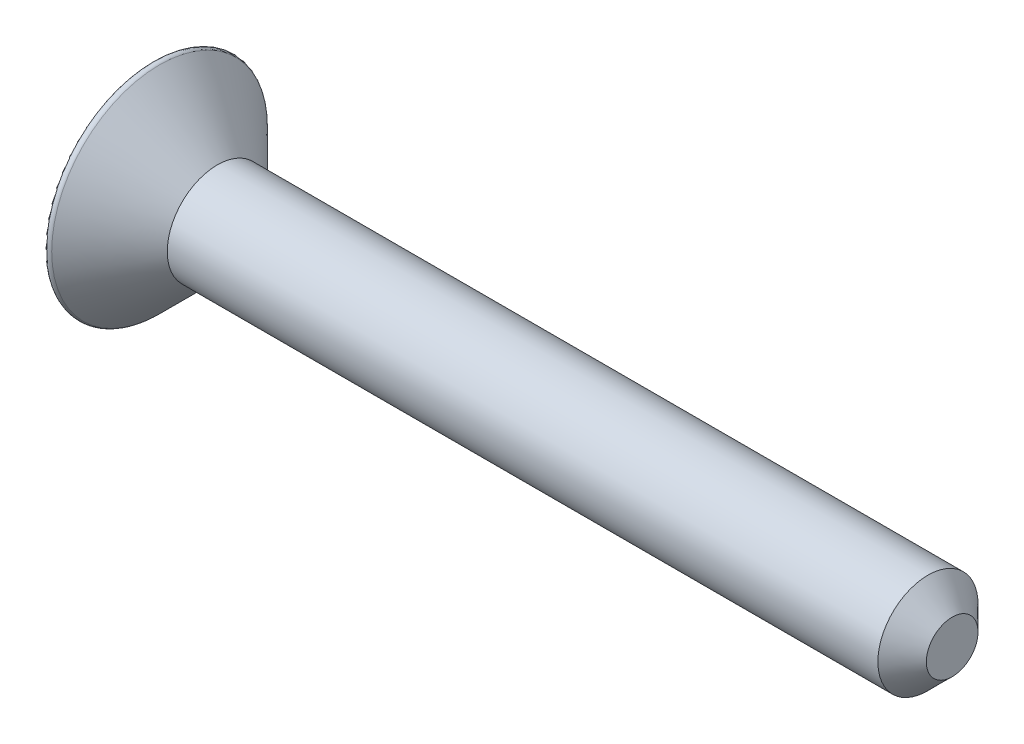
ISO-10303-21;
HEADER;
FILE_DESCRIPTION(('STEP AP214'),'2;1');
FILE_NAME('part.step','',(''),(''),'','','');
FILE_SCHEMA(('AUTOMOTIVE_DESIGN { 1 0 10303 214 1 1 1 1 }'));
ENDSEC;
DATA;
#1=APPLICATION_CONTEXT('core data for automotive mechanical design processes');
#2=APPLICATION_PROTOCOL_DEFINITION('international standard','automotive_design',2000,#1);
#3=PRODUCT_CONTEXT('',#1,'mechanical');
#4=PRODUCT('Part','Part','',(#3));
#5=PRODUCT_RELATED_PRODUCT_CATEGORY('part','',(#4));
#6=PRODUCT_DEFINITION_FORMATION('','',#4);
#7=PRODUCT_DEFINITION_CONTEXT('part definition',#1,'design');
#8=PRODUCT_DEFINITION('design','',#6,#7);
#9=PRODUCT_DEFINITION_SHAPE('','',#8);
#10=(LENGTH_UNIT() NAMED_UNIT(*) SI_UNIT(.MILLI.,.METRE.));
#11=(NAMED_UNIT(*) PLANE_ANGLE_UNIT() SI_UNIT($,.RADIAN.));
#12=(NAMED_UNIT(*) SI_UNIT($,.STERADIAN.) SOLID_ANGLE_UNIT());
#13=UNCERTAINTY_MEASURE_WITH_UNIT(LENGTH_MEASURE(1.E-05),#10,'distance_accuracy_value','');
#14=(GEOMETRIC_REPRESENTATION_CONTEXT(3) GLOBAL_UNCERTAINTY_ASSIGNED_CONTEXT((#13)) GLOBAL_UNIT_ASSIGNED_CONTEXT((#10,
#11,#12)) REPRESENTATION_CONTEXT('',''));
#15=CARTESIAN_POINT('',(0.,0.,0.));
#16=DIRECTION('',(0.,0.,1.));
#17=DIRECTION('',(1.,0.,0.));
#18=AXIS2_PLACEMENT_3D('',#15,#16,#17);
#19=CARTESIAN_POINT('',(0.,0.,0.));
#20=DIRECTION('',(1.,0.,0.));
#21=DIRECTION('',(0.,1.,0.));
#22=AXIS2_PLACEMENT_3D('',#19,#20,#21);
#23=PLANE('',#22);
#24=CARTESIAN_POINT('',(0.,0.,0.));
#25=DIRECTION('',(1.,0.,0.));
#26=DIRECTION('',(0.,1.,0.));
#27=AXIS2_PLACEMENT_3D('',#24,#25,#26);
#28=CIRCLE('',#27,0.812799999999999);
#29=CARTESIAN_POINT('',(0.,0.812799999999999,0.));
#30=VERTEX_POINT('',#29);
#31=EDGE_CURVE('E11',#30,#30,#28,.T.);
#32=ORIENTED_EDGE('',*,*,#31,.T.);
#33=EDGE_LOOP('',(#32));
#34=FACE_BOUND('',#33,.T.);
#35=ADVANCED_FACE('F38',(#34),#23,.T.);
#36=CARTESIAN_POINT('',(0.,0.,0.));
#37=DIRECTION('',(-1.,0.,0.));
#38=DIRECTION('',(0.,-1.,0.));
#39=AXIS2_PLACEMENT_3D('',#36,#37,#38);
#40=CONICAL_SURFACE('',#39,0.812799999999999,0.785398163397449);
#41=CARTESIAN_POINT('',(-0.761999999999999,0.,0.));
#42=DIRECTION('',(1.,0.,0.));
#43=DIRECTION('',(0.,1.,0.));
#44=AXIS2_PLACEMENT_3D('',#41,#42,#43);
#45=CIRCLE('',#44,1.5748);
#46=CARTESIAN_POINT('',(-0.761999999999999,1.57480000000001,0.));
#47=VERTEX_POINT('',#46);
#48=EDGE_CURVE('E45',#47,#47,#45,.T.);
#49=ORIENTED_EDGE('',*,*,#48,.T.);
#50=EDGE_LOOP('',(#49));
#51=FACE_BOUND('',#50,.T.);
#52=ORIENTED_EDGE('',*,*,#31,.F.);
#53=EDGE_LOOP('',(#52));
#54=FACE_BOUND('',#53,.T.);
#55=ADVANCED_FACE('F196',(#51,#54),#40,.T.);
#56=CARTESIAN_POINT('',(0.,0.,0.));
#57=DIRECTION('',(1.,0.,0.));
#58=DIRECTION('',(0.,1.,0.));
#59=AXIS2_PLACEMENT_3D('',#56,#57,#58);
#60=CYLINDRICAL_SURFACE('',#59,1.5748);
#61=CARTESIAN_POINT('',(-23.1121948775787,0.,0.));
#62=DIRECTION('',(1.,0.,0.));
#63=DIRECTION('',(0.,1.,0.));
#64=AXIS2_PLACEMENT_3D('',#61,#62,#63);
#65=CIRCLE('',#64,1.5748);
#66=CARTESIAN_POINT('',(-23.1121948775787,1.57480000000002,0.));
#67=VERTEX_POINT('',#66);
#68=EDGE_CURVE('E191',#67,#67,#65,.T.);
#69=ORIENTED_EDGE('',*,*,#68,.T.);
#70=EDGE_LOOP('',(#69));
#71=FACE_BOUND('',#70,.T.);
#72=ORIENTED_EDGE('',*,*,#48,.F.);
#73=EDGE_LOOP('',(#72));
#74=FACE_BOUND('',#73,.T.);
#75=ADVANCED_FACE('F199',(#71,#74),#60,.T.);
#76=CARTESIAN_POINT('',(-23.1121948775787,0.,0.));
#77=DIRECTION('',(-1.,0.,0.));
#78=DIRECTION('',(0.,-1.,0.));
#79=AXIS2_PLACEMENT_3D('',#76,#77,#78);
#80=CONICAL_SURFACE('',#79,1.5748,0.785398163397454);
#81=CARTESIAN_POINT('',(-24.9291974387893,0.,0.));
#82=DIRECTION('',(1.,0.,0.));
#83=DIRECTION('',(0.,1.,0.));
#84=AXIS2_PLACEMENT_3D('',#81,#82,#83);
#85=CIRCLE('',#84,3.39180256121069);
#86=CARTESIAN_POINT('',(-24.9291974387893,3.39180256121071,0.));
#87=VERTEX_POINT('',#86);
#88=EDGE_CURVE('E188',#87,#87,#85,.T.);
#89=ORIENTED_EDGE('',*,*,#88,.T.);
#90=EDGE_LOOP('',(#89));
#91=FACE_BOUND('',#90,.T.);
#92=ORIENTED_EDGE('',*,*,#68,.F.);
#93=EDGE_LOOP('',(#92));
#94=FACE_BOUND('',#93,.T.);
#95=ADVANCED_FACE('F201',(#91,#94),#80,.T.);
#96=CARTESIAN_POINT('',(-25.019,0.,0.));
#97=DIRECTION('',(1.,0.,0.));
#98=DIRECTION('',(0.,1.,0.));
#99=AXIS2_PLACEMENT_3D('',#96,#97,#98);
#100=TOROIDAL_SURFACE('',#99,3.302,0.126999999999999);
#101=CARTESIAN_POINT('',(-25.146,0.,0.));
#102=DIRECTION('',(1.,0.,0.));
#103=DIRECTION('',(0.,1.,0.));
#104=AXIS2_PLACEMENT_3D('',#101,#102,#103);
#105=CIRCLE('',#104,3.302);
#106=CARTESIAN_POINT('',(-25.146,3.30200000000002,0.));
#107=VERTEX_POINT('',#106);
#108=EDGE_CURVE('E185',#107,#107,#105,.T.);
#109=ORIENTED_EDGE('',*,*,#108,.T.);
#110=EDGE_LOOP('',(#109));
#111=FACE_BOUND('',#110,.T.);
#112=ORIENTED_EDGE('',*,*,#88,.F.);
#113=EDGE_LOOP('',(#112));
#114=FACE_BOUND('',#113,.T.);
#115=ADVANCED_FACE('F208',(#111,#114),#100,.T.);
#116=CARTESIAN_POINT('',(-25.146,0.,0.));
#117=DIRECTION('',(-1.,0.,0.));
#118=DIRECTION('',(0.,-1.,0.));
#119=AXIS2_PLACEMENT_3D('',#116,#117,#118);
#120=PLANE('',#119);
#121=DIRECTION('',(0.,0.,-1.));
#122=VECTOR('',#121,1.);
#123=CARTESIAN_POINT('',(-25.146,0.291765623733873,-0.292651894255876));
#124=LINE('',#123,#122);
#125=CARTESIAN_POINT('',(-25.146,0.291765623733873,-0.292651894255876));
#126=VERTEX_POINT('',#125);
#127=CARTESIAN_POINT('',(-25.146,0.291765623733896,-2.6459076439851));
#128=VERTEX_POINT('',#127);
#129=EDGE_CURVE('E134',#126,#128,#124,.T.);
#130=ORIENTED_EDGE('',*,*,#129,.F.);
#131=DIRECTION('',(0.,-1.,0.));
#132=VECTOR('',#131,1.);
#133=CARTESIAN_POINT('',(-25.146,0.291765623733873,-0.292651894255876));
#134=LINE('',#133,#132);
#135=CARTESIAN_POINT('',(-25.146,2.65394488263836,-0.292651894255882));
#136=VERTEX_POINT('',#135);
#137=EDGE_CURVE('E113',#136,#126,#134,.T.);
#138=ORIENTED_EDGE('',*,*,#137,.F.);
#139=DIRECTION('',(0.,0.,-1.));
#140=VECTOR('',#139,1.);
#141=CARTESIAN_POINT('',(-25.146,2.65394488263836,-0.292651894255882));
#142=LINE('',#141,#140);
#143=CARTESIAN_POINT('',(-25.146,2.65394488263838,0.292651894255869));
#144=VERTEX_POINT('',#143);
#145=EDGE_CURVE('E123',#144,#136,#142,.T.);
#146=ORIENTED_EDGE('',*,*,#145,.F.);
#147=DIRECTION('',(0.,1.,0.));
#148=VECTOR('',#147,1.);
#149=CARTESIAN_POINT('',(-25.146,0.291765623733901,0.292651894255846));
#150=LINE('',#149,#148);
#151=CARTESIAN_POINT('',(-25.146,0.291765623733901,0.292651894255846));
#152=VERTEX_POINT('',#151);
#153=EDGE_CURVE('E120',#152,#144,#150,.T.);
#154=ORIENTED_EDGE('',*,*,#153,.F.);
#155=DIRECTION('',(0.,0.,-0.999999999999999));
#156=VECTOR('',#155,1.);
#157=CARTESIAN_POINT('',(-25.146,0.291765623733873,2.64590764398509));
#158=LINE('',#157,#156);
#159=CARTESIAN_POINT('',(-25.146,0.291765623733873,2.64590764398509));
#160=VERTEX_POINT('',#159);
#161=EDGE_CURVE('E157',#160,#152,#158,.T.);
#162=ORIENTED_EDGE('',*,*,#161,.F.);
#163=DIRECTION('',(0.,1.,0.));
#164=VECTOR('',#163,1.);
#165=CARTESIAN_POINT('',(-25.146,0.291765623733873,2.64590764398509));
#166=LINE('',#165,#164);
#167=CARTESIAN_POINT('',(-25.146,-0.291765623733894,2.64590764398509));
#168=VERTEX_POINT('',#167);
#169=EDGE_CURVE('E154',#168,#160,#166,.T.);
#170=ORIENTED_EDGE('',*,*,#169,.F.);
#171=DIRECTION('',(0.,0.,1.));
#172=VECTOR('',#171,1.);
#173=CARTESIAN_POINT('',(-25.146,-0.291765623733894,2.64590764398509));
#174=LINE('',#173,#172);
#175=CARTESIAN_POINT('',(-25.146,-0.291765623733878,0.292651894255862));
#176=VERTEX_POINT('',#175);
#177=EDGE_CURVE('E151',#176,#168,#174,.T.);
#178=ORIENTED_EDGE('',*,*,#177,.F.);
#179=DIRECTION('',(0.,0.999999999999999,0.));
#180=VECTOR('',#179,1.);
#181=CARTESIAN_POINT('',(-25.146,-2.65394488263838,0.292651894255855));
#182=LINE('',#181,#180);
#183=CARTESIAN_POINT('',(-25.146,-2.65394488263838,0.292651894255855));
#184=VERTEX_POINT('',#183);
#185=EDGE_CURVE('E148',#184,#176,#182,.T.);
#186=ORIENTED_EDGE('',*,*,#185,.F.);
#187=DIRECTION('',(0.,0.,1.));
#188=VECTOR('',#187,1.);
#189=CARTESIAN_POINT('',(-25.146,-2.65394488263836,-0.292651894255875));
#190=LINE('',#189,#188);
#191=CARTESIAN_POINT('',(-25.146,-2.65394488263836,-0.292651894255875));
#192=VERTEX_POINT('',#191);
#193=EDGE_CURVE('E145',#192,#184,#190,.T.);
#194=ORIENTED_EDGE('',*,*,#193,.F.);
#195=DIRECTION('',(0.,-1.,0.));
#196=VECTOR('',#195,1.);
#197=CARTESIAN_POINT('',(-25.146,-2.65394488263836,-0.292651894255875));
#198=LINE('',#197,#196);
#199=CARTESIAN_POINT('',(-25.146,-0.29176562373388,-0.292651894255885));
#200=VERTEX_POINT('',#199);
#201=EDGE_CURVE('E142',#200,#192,#198,.T.);
#202=ORIENTED_EDGE('',*,*,#201,.F.);
#203=DIRECTION('',(0.,0.,1.));
#204=VECTOR('',#203,1.);
#205=CARTESIAN_POINT('',(-25.146,-0.29176562373388,-0.292651894255885));
#206=LINE('',#205,#204);
#207=CARTESIAN_POINT('',(-25.146,-0.291765623733875,-2.64590764398512));
#208=VERTEX_POINT('',#207);
#209=EDGE_CURVE('E52',#208,#200,#206,.T.);
#210=ORIENTED_EDGE('',*,*,#209,.F.);
#211=DIRECTION('',(0.,-1.,0.));
#212=VECTOR('',#211,1.);
#213=CARTESIAN_POINT('',(-25.146,0.291765623733896,-2.6459076439851));
#214=LINE('',#213,#212);
#215=EDGE_CURVE('E136',#128,#208,#214,.T.);
#216=ORIENTED_EDGE('',*,*,#215,.F.);
#217=EDGE_LOOP('',(#130,#138,#146,#154,#162,#170,#178,#186,#194,#202,#210,#216));
#218=FACE_BOUND('',#217,.T.);
#219=ORIENTED_EDGE('',*,*,#108,.F.);
#220=EDGE_LOOP('',(#219));
#221=FACE_BOUND('',#220,.T.);
#222=ADVANCED_FACE('F130',(#218,#221),#120,.T.);
#223=CARTESIAN_POINT('',(-25.146,2.65394488263836,-0.292651894255882));
#224=DIRECTION('',(0.559192903470747,0.829037572555041,0.));
#225=DIRECTION('',(-0.829037572555042,0.559192903470747,0.));
#226=AXIS2_PLACEMENT_3D('',#223,#224,#225);
#227=PLANE('',#226);
#228=ORIENTED_EDGE('',*,*,#145,.T.);
#229=DIRECTION('',(-0.723589100218006,0.488067010791395,-0.488067010791395));
#230=VECTOR('',#229,1.);
#231=CARTESIAN_POINT('',(-25.146,2.65394488263836,-0.292651894255882));
#232=LINE('',#231,#230);
#233=CARTESIAN_POINT('',(-24.7121257242149,2.3612929883825,0.));
#234=VERTEX_POINT('',#233);
#235=EDGE_CURVE('E109',#234,#136,#232,.T.);
#236=ORIENTED_EDGE('',*,*,#235,.F.);
#237=DIRECTION('',(-0.723589100218007,0.488067010791395,0.488067010791395));
#238=VECTOR('',#237,1.);
#239=CARTESIAN_POINT('',(-24.3117728457167,2.09125156209305,-0.270041426289446));
#240=LINE('',#239,#238);
#241=EDGE_CURVE('E125',#234,#144,#240,.T.);
#242=ORIENTED_EDGE('',*,*,#241,.T.);
#243=EDGE_LOOP('',(#228,#236,#242));
#244=FACE_BOUND('',#243,.T.);
#245=ADVANCED_FACE('F124',(#244),#227,.F.);
#246=CARTESIAN_POINT('',(-25.146,0.291765623733873,2.64590764398509));
#247=DIRECTION('',(0.559192903470747,0.82903757255504,0.));
#248=DIRECTION('',(-0.829037572555042,0.559192903470747,0.));
#249=AXIS2_PLACEMENT_3D('',#246,#247,#248);
#250=PLANE('',#249);
#251=DIRECTION('',(-0.723589100218007,0.488067010791395,0.488067010791395));
#252=VECTOR('',#251,1.);
#253=CARTESIAN_POINT('',(-25.146,0.291765623733873,2.64590764398509));
#254=LINE('',#253,#252);
#255=CARTESIAN_POINT('',(-24.7134396742983,0.,2.35414202025119));
#256=VERTEX_POINT('',#255);
#257=EDGE_CURVE('E179',#256,#160,#254,.T.);
#258=ORIENTED_EDGE('',*,*,#257,.T.);
#259=ORIENTED_EDGE('',*,*,#161,.T.);
#260=DIRECTION('',(-0.723589100218007,0.488067010791395,0.488067010791395));
#261=VECTOR('',#260,1.);
#262=CARTESIAN_POINT('',(-25.146,0.291765623733901,0.292651894255846));
#263=LINE('',#262,#261);
#264=CARTESIAN_POINT('',(-24.7134396742983,0.,0.000886270521987913));
#265=VERTEX_POINT('',#264);
#266=EDGE_CURVE('E162',#265,#152,#263,.T.);
#267=ORIENTED_EDGE('',*,*,#266,.F.);
#268=DIRECTION('',(0.,0.,-0.999999999999999));
#269=VECTOR('',#268,1.);
#270=CARTESIAN_POINT('',(-24.7134396742983,0.,2.64590764398508));
#271=LINE('',#270,#269);
#272=EDGE_CURVE('E161',#256,#265,#271,.T.);
#273=ORIENTED_EDGE('',*,*,#272,.F.);
#274=EDGE_LOOP('',(#258,#259,#267,#273));
#275=FACE_BOUND('',#274,.T.);
#276=ADVANCED_FACE('F256',(#275),#250,.F.);
#277=CARTESIAN_POINT('',(-25.146,0.291765623733873,2.64590764398509));
#278=DIRECTION('',(0.559192903470747,0.,0.829037572555041));
#279=DIRECTION('',(0.829037572555041,0.,-0.559192903470747));
#280=AXIS2_PLACEMENT_3D('',#277,#278,#279);
#281=PLANE('',#280);
#282=ORIENTED_EDGE('',*,*,#169,.T.);
#283=ORIENTED_EDGE('',*,*,#257,.F.);
#284=DIRECTION('',(-0.723589100218008,-0.488067010791394,0.488067010791395));
#285=VECTOR('',#284,1.);
#286=CARTESIAN_POINT('',(-25.146,-0.291765623733894,2.64590764398509));
#287=LINE('',#286,#285);
#288=EDGE_CURVE('E177',#256,#168,#287,.T.);
#289=ORIENTED_EDGE('',*,*,#288,.T.);
#290=EDGE_LOOP('',(#282,#283,#289));
#291=FACE_BOUND('',#290,.T.);
#292=ADVANCED_FACE('F265',(#291),#281,.F.);
#293=CARTESIAN_POINT('',(-25.146,-0.291765623733894,2.64590764398509));
#294=DIRECTION('',(0.559192903470747,-0.829037572555041,0.));
#295=DIRECTION('',(0.829037572555042,0.559192903470747,0.));
#296=AXIS2_PLACEMENT_3D('',#293,#294,#295);
#297=PLANE('',#296);
#298=ORIENTED_EDGE('',*,*,#272,.T.);
#299=DIRECTION('',(-0.723589100218008,-0.488067010791394,0.488067010791395));
#300=VECTOR('',#299,1.);
#301=CARTESIAN_POINT('',(-25.9770757280579,-0.852333280449993,0.853219550971958));
#302=LINE('',#301,#300);
#303=EDGE_CURVE('E175',#265,#176,#302,.T.);
#304=ORIENTED_EDGE('',*,*,#303,.T.);
#305=ORIENTED_EDGE('',*,*,#177,.T.);
#306=ORIENTED_EDGE('',*,*,#288,.F.);
#307=EDGE_LOOP('',(#298,#304,#305,#306));
#308=FACE_BOUND('',#307,.T.);
#309=ADVANCED_FACE('F275',(#308),#297,.F.);
#310=CARTESIAN_POINT('',(-25.146,-2.65394488263838,0.292651894255855));
#311=DIRECTION('',(0.559192903470747,0.,0.829037572555041));
#312=DIRECTION('',(0.829037572555041,0.,-0.559192903470747));
#313=AXIS2_PLACEMENT_3D('',#310,#311,#312);
#314=PLANE('',#313);
#315=DIRECTION('',(0.,0.999999999999999,0.));
#316=VECTOR('',#315,1.);
#317=CARTESIAN_POINT('',(-24.7121257242149,-2.65394488263837,0.));
#318=LINE('',#317,#316);
#319=CARTESIAN_POINT('',(-24.7121257242149,-2.36129298838251,0.));
#320=VERTEX_POINT('',#319);
#321=EDGE_CURVE('E116',#320,#234,#318,.T.);
#322=ORIENTED_EDGE('',*,*,#321,.F.);
#323=DIRECTION('',(-0.723589100218008,-0.488067010791394,0.488067010791395));
#324=VECTOR('',#323,1.);
#325=CARTESIAN_POINT('',(-24.9392941320855,-2.51452001424877,0.153227025866252));
#326=LINE('',#325,#324);
#327=EDGE_CURVE('E173',#320,#184,#326,.T.);
#328=ORIENTED_EDGE('',*,*,#327,.T.);
#329=ORIENTED_EDGE('',*,*,#185,.T.);
#330=ORIENTED_EDGE('',*,*,#303,.F.);
#331=ORIENTED_EDGE('',*,*,#266,.T.);
#332=ORIENTED_EDGE('',*,*,#153,.T.);
#333=ORIENTED_EDGE('',*,*,#241,.F.);
#334=EDGE_LOOP('',(#322,#328,#329,#330,#331,#332,#333));
#335=FACE_BOUND('',#334,.T.);
#336=ADVANCED_FACE('F285',(#335),#314,.F.);
#337=CARTESIAN_POINT('',(-25.146,-2.65394488263836,-0.292651894255875));
#338=DIRECTION('',(0.559192903470747,-0.829037572555041,0.));
#339=DIRECTION('',(0.829037572555042,0.559192903470747,0.));
#340=AXIS2_PLACEMENT_3D('',#337,#338,#339);
#341=PLANE('',#340);
#342=ORIENTED_EDGE('',*,*,#193,.T.);
#343=ORIENTED_EDGE('',*,*,#327,.F.);
#344=DIRECTION('',(-0.723589100218007,-0.488067010791395,-0.488067010791395));
#345=VECTOR('',#344,1.);
#346=CARTESIAN_POINT('',(-25.146,-2.65394488263836,-0.292651894255875));
#347=LINE('',#346,#345);
#348=EDGE_CURVE('E171',#320,#192,#347,.T.);
#349=ORIENTED_EDGE('',*,*,#348,.T.);
#350=EDGE_LOOP('',(#342,#343,#349));
#351=FACE_BOUND('',#350,.T.);
#352=ADVANCED_FACE('F296',(#351),#341,.F.);
#353=CARTESIAN_POINT('',(-25.146,-0.29176562373388,-0.292651894255885));
#354=DIRECTION('',(0.559192903470747,-0.829037572555041,0.));
#355=DIRECTION('',(0.829037572555042,0.559192903470747,0.));
#356=AXIS2_PLACEMENT_3D('',#353,#354,#355);
#357=PLANE('',#356);
#358=DIRECTION('',(-0.723589100218007,-0.488067010791395,-0.488067010791395));
#359=VECTOR('',#358,1.);
#360=CARTESIAN_POINT('',(-24.939920122626,-0.152762991295291,-2.50690501154651));
#361=LINE('',#360,#359);
#362=CARTESIAN_POINT('',(-24.7134396742983,0.,-2.35414202025123));
#363=VERTEX_POINT('',#362);
#364=EDGE_CURVE('E167',#363,#208,#361,.T.);
#365=ORIENTED_EDGE('',*,*,#364,.T.);
#366=ORIENTED_EDGE('',*,*,#209,.T.);
#367=DIRECTION('',(-0.723589100218007,-0.488067010791395,-0.488067010791395));
#368=VECTOR('',#367,1.);
#369=CARTESIAN_POINT('',(-25.9802271542833,-0.854458944279194,-0.855345214801189));
#370=LINE('',#369,#368);
#371=CARTESIAN_POINT('',(-24.7134396742983,0.,-0.000886270521993984));
#372=VERTEX_POINT('',#371);
#373=EDGE_CURVE('E169',#372,#200,#370,.T.);
#374=ORIENTED_EDGE('',*,*,#373,.F.);
#375=DIRECTION('',(0.,0.,1.));
#376=VECTOR('',#375,1.);
#377=CARTESIAN_POINT('',(-24.7134396742983,0.,-0.292651894255877));
#378=LINE('',#377,#376);
#379=EDGE_CURVE('E60',#363,#372,#378,.T.);
#380=ORIENTED_EDGE('',*,*,#379,.F.);
#381=EDGE_LOOP('',(#365,#366,#374,#380));
#382=FACE_BOUND('',#381,.T.);
#383=ADVANCED_FACE('F306',(#382),#357,.F.);
#384=CARTESIAN_POINT('',(-25.146,0.291765623733896,-2.6459076439851));
#385=DIRECTION('',(0.559192903470747,0.,-0.829037572555041));
#386=DIRECTION('',(-0.829037572555041,0.,-0.559192903470746));
#387=AXIS2_PLACEMENT_3D('',#384,#385,#386);
#388=PLANE('',#387);
#389=ORIENTED_EDGE('',*,*,#215,.T.);
#390=ORIENTED_EDGE('',*,*,#364,.F.);
#391=DIRECTION('',(-0.723589100218006,0.488067010791395,-0.488067010791395));
#392=VECTOR('',#391,1.);
#393=CARTESIAN_POINT('',(-24.314924271942,-0.268802032982211,-2.08533998726899));
#394=LINE('',#393,#392);
#395=EDGE_CURVE('E165',#363,#128,#394,.T.);
#396=ORIENTED_EDGE('',*,*,#395,.T.);
#397=EDGE_LOOP('',(#389,#390,#396));
#398=FACE_BOUND('',#397,.T.);
#399=ADVANCED_FACE('F316',(#398),#388,.F.);
#400=CARTESIAN_POINT('',(-25.146,0.291765623733873,-0.292651894255876));
#401=DIRECTION('',(0.559192903470747,0.829037572555041,0.));
#402=DIRECTION('',(-0.829037572555042,0.559192903470747,0.));
#403=AXIS2_PLACEMENT_3D('',#400,#401,#402);
#404=PLANE('',#403);
#405=ORIENTED_EDGE('',*,*,#379,.T.);
#406=DIRECTION('',(-0.723589100218006,0.488067010791395,-0.488067010791395));
#407=VECTOR('',#406,1.);
#408=CARTESIAN_POINT('',(-25.146,0.291765623733873,-0.292651894255876));
#409=LINE('',#408,#407);
#410=EDGE_CURVE('E119',#372,#126,#409,.T.);
#411=ORIENTED_EDGE('',*,*,#410,.T.);
#412=ORIENTED_EDGE('',*,*,#129,.T.);
#413=ORIENTED_EDGE('',*,*,#395,.F.);
#414=EDGE_LOOP('',(#405,#411,#412,#413));
#415=FACE_BOUND('',#414,.T.);
#416=ADVANCED_FACE('F325',(#415),#404,.F.);
#417=CARTESIAN_POINT('',(-25.146,0.291765623733873,-0.292651894255876));
#418=DIRECTION('',(0.559192903470747,0.,-0.829037572555041));
#419=DIRECTION('',(-0.829037572555041,0.,-0.559192903470746));
#420=AXIS2_PLACEMENT_3D('',#417,#418,#419);
#421=PLANE('',#420);
#422=ORIENTED_EDGE('',*,*,#235,.T.);
#423=ORIENTED_EDGE('',*,*,#137,.T.);
#424=ORIENTED_EDGE('',*,*,#410,.F.);
#425=ORIENTED_EDGE('',*,*,#373,.T.);
#426=ORIENTED_EDGE('',*,*,#201,.T.);
#427=ORIENTED_EDGE('',*,*,#348,.F.);
#428=ORIENTED_EDGE('',*,*,#321,.T.);
#429=EDGE_LOOP('',(#422,#423,#424,#425,#426,#427,#428));
#430=FACE_BOUND('',#429,.T.);
#431=ADVANCED_FACE('F111',(#430),#421,.F.);
#432=CLOSED_SHELL('',(#35,#55,#75,#95,#115,#222,#245,#276,#292,#309,#336,#352,#383,#399,#416,#431));
#433=MANIFOLD_SOLID_BREP('B2',#432);
#434=ADVANCED_BREP_SHAPE_REPRESENTATION('',(#18,#433),#14);
#435=SHAPE_DEFINITION_REPRESENTATION(#9,#434);
ENDSEC;
END-ISO-10303-21;
